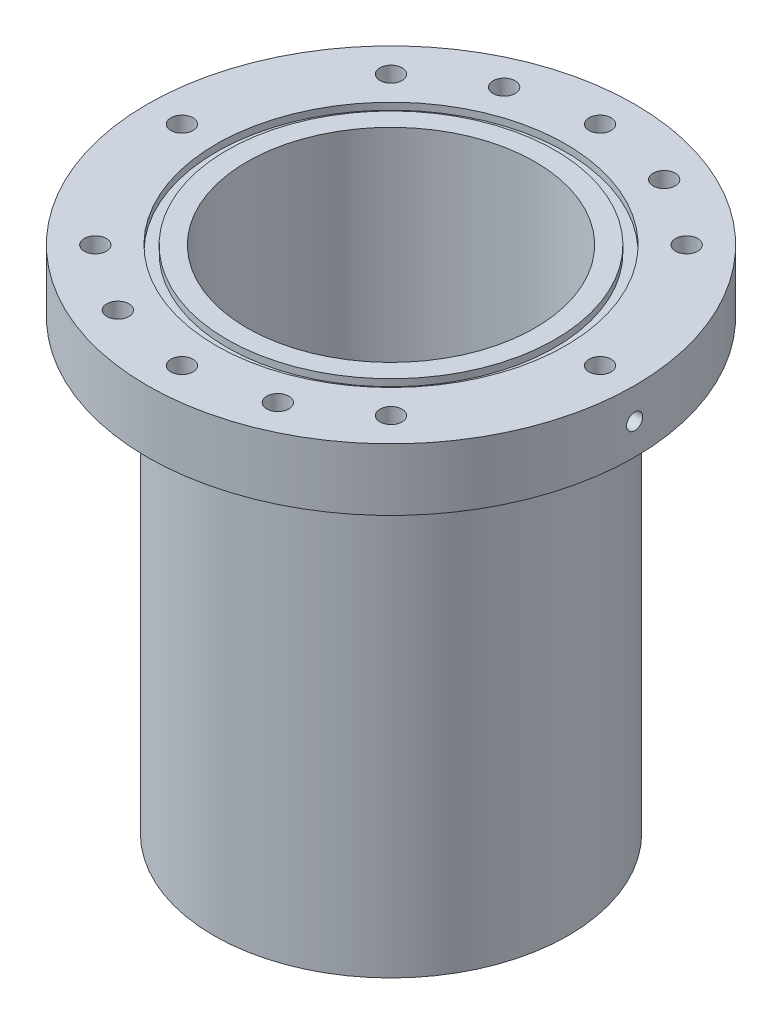
ISO-10303-21;
HEADER;
FILE_DESCRIPTION(('STEP AP214'),'2;1');
FILE_NAME('part.step','',(''),(''),'','','');
FILE_SCHEMA(('AUTOMOTIVE_DESIGN { 1 0 10303 214 1 1 1 1 }'));
ENDSEC;
DATA;
#1=APPLICATION_CONTEXT('core data for automotive mechanical design processes');
#2=APPLICATION_PROTOCOL_DEFINITION('international standard','automotive_design',2000,#1);
#3=PRODUCT_CONTEXT('',#1,'mechanical');
#4=PRODUCT('Part','Part','',(#3));
#5=PRODUCT_RELATED_PRODUCT_CATEGORY('part','',(#4));
#6=PRODUCT_DEFINITION_FORMATION('','',#4);
#7=PRODUCT_DEFINITION_CONTEXT('part definition',#1,'design');
#8=PRODUCT_DEFINITION('design','',#6,#7);
#9=PRODUCT_DEFINITION_SHAPE('','',#8);
#10=(LENGTH_UNIT() NAMED_UNIT(*) SI_UNIT(.MILLI.,.METRE.));
#11=(NAMED_UNIT(*) PLANE_ANGLE_UNIT() SI_UNIT($,.RADIAN.));
#12=(NAMED_UNIT(*) SI_UNIT($,.STERADIAN.) SOLID_ANGLE_UNIT());
#13=UNCERTAINTY_MEASURE_WITH_UNIT(LENGTH_MEASURE(1.E-05),#10,'distance_accuracy_value','');
#14=(GEOMETRIC_REPRESENTATION_CONTEXT(3) GLOBAL_UNCERTAINTY_ASSIGNED_CONTEXT((#13)) GLOBAL_UNIT_ASSIGNED_CONTEXT((#10,
#11,#12)) REPRESENTATION_CONTEXT('',''));
#15=CARTESIAN_POINT('',(0.,0.,0.));
#16=DIRECTION('',(0.,0.,1.));
#17=DIRECTION('',(1.,0.,0.));
#18=AXIS2_PLACEMENT_3D('',#15,#16,#17);
#19=CARTESIAN_POINT('',(0.,292.1,0.));
#20=DIRECTION('',(0.,-1.,0.));
#21=DIRECTION('',(0.,0.,-1.));
#22=AXIS2_PLACEMENT_3D('',#19,#20,#21);
#23=CYLINDRICAL_SURFACE('',#22,50.8);
#24=CARTESIAN_POINT('',(0.,269.5575,0.));
#25=DIRECTION('',(0.,1.,0.));
#26=DIRECTION('',(0.,0.,1.));
#27=AXIS2_PLACEMENT_3D('',#24,#25,#26);
#28=CIRCLE('',#27,50.8);
#29=CARTESIAN_POINT('',(0.,269.5575,50.8));
#30=VERTEX_POINT('',#29);
#31=EDGE_CURVE('E190',#30,#30,#28,.F.);
#32=ORIENTED_EDGE('',*,*,#31,.T.);
#33=EDGE_LOOP('',(#32));
#34=FACE_BOUND('',#33,.T.);
#35=CARTESIAN_POINT('',(0.,146.05,0.));
#36=DIRECTION('',(0.,-1.,0.));
#37=DIRECTION('',(0.,0.,-1.));
#38=AXIS2_PLACEMENT_3D('',#35,#36,#37);
#39=CIRCLE('',#38,50.8);
#40=CARTESIAN_POINT('',(0.,146.05,-50.8));
#41=VERTEX_POINT('',#40);
#42=EDGE_CURVE('E193',#41,#41,#39,.T.);
#43=ORIENTED_EDGE('',*,*,#42,.F.);
#44=EDGE_LOOP('',(#43));
#45=FACE_BOUND('',#44,.T.);
#46=ADVANCED_FACE('F33',(#34,#45),#23,.T.);
#47=CARTESIAN_POINT('',(0.,292.1,0.));
#48=DIRECTION('',(0.,-1.,0.));
#49=DIRECTION('',(0.,0.,-1.));
#50=AXIS2_PLACEMENT_3D('',#47,#48,#49);
#51=CYLINDRICAL_SURFACE('',#50,41.275);
#52=CARTESIAN_POINT('',(0.,292.1,0.));
#53=DIRECTION('',(0.,1.,0.));
#54=DIRECTION('',(0.,0.,1.));
#55=AXIS2_PLACEMENT_3D('',#52,#53,#54);
#56=CIRCLE('',#55,41.275);
#57=CARTESIAN_POINT('',(0.,292.1,41.275));
#58=VERTEX_POINT('',#57);
#59=EDGE_CURVE('E294',#58,#58,#56,.T.);
#60=ORIENTED_EDGE('',*,*,#59,.T.);
#61=EDGE_LOOP('',(#60));
#62=FACE_BOUND('',#61,.T.);
#63=CARTESIAN_POINT('',(0.,146.05,0.));
#64=DIRECTION('',(0.,-1.,0.));
#65=DIRECTION('',(0.,0.,-1.));
#66=AXIS2_PLACEMENT_3D('',#63,#64,#65);
#67=CIRCLE('',#66,41.275);
#68=CARTESIAN_POINT('',(0.,146.05,-41.275));
#69=VERTEX_POINT('',#68);
#70=EDGE_CURVE('E37',#69,#69,#67,.T.);
#71=ORIENTED_EDGE('',*,*,#70,.T.);
#72=EDGE_LOOP('',(#71));
#73=FACE_BOUND('',#72,.T.);
#74=ADVANCED_FACE('F180',(#62,#73),#51,.F.);
#75=CARTESIAN_POINT('',(0.,274.32,0.));
#76=DIRECTION('',(0.,1.,0.));
#77=DIRECTION('',(0.,0.,1.));
#78=AXIS2_PLACEMENT_3D('',#75,#76,#77);
#79=CYLINDRICAL_SURFACE('',#78,69.85);
#80=CARTESIAN_POINT('',(69.8117463614827,283.21,-2.3114));
#81=CARTESIAN_POINT('',(69.8117468773619,283.339794212709,-2.31139425584525));
#82=CARTESIAN_POINT('',(69.8121122207272,283.469681633837,-2.30043061613104));
#83=CARTESIAN_POINT('',(69.8135344596974,283.725876692424,-2.25684808828962));
#84=CARTESIAN_POINT('',(69.8145921799757,283.852179873374,-2.22420337568277));
#85=CARTESIAN_POINT('',(69.8172792245899,284.097457921225,-2.13819138738273));
#86=CARTESIAN_POINT('',(69.8189082678216,284.216436358291,-2.08483430128465));
#87=CARTESIAN_POINT('',(69.8225540390404,284.443714312266,-1.95892691975963));
#88=CARTESIAN_POINT('',(69.8245706727383,284.552016416733,-1.88638129072129));
#89=CARTESIAN_POINT('',(69.8287656198329,284.754957345675,-1.72411207413871));
#90=CARTESIAN_POINT('',(69.8309440050557,284.849590044616,-1.63438082700794));
#91=CARTESIAN_POINT('',(69.8352162830058,285.022454195481,-1.44030133615428));
#92=CARTESIAN_POINT('',(69.8373101723555,285.100684992288,-1.33595250886022));
#93=CARTESIAN_POINT('',(69.8411778374989,285.238535920976,-1.11557502998445));
#94=CARTESIAN_POINT('',(69.8429515457036,285.298152125327,-0.999543920354352));
#95=CARTESIAN_POINT('',(69.8459783152063,285.397056117881,-0.759113043697639));
#96=CARTESIAN_POINT('',(69.8472313788171,285.436343996383,-0.634713313847597));
#97=CARTESIAN_POINT('',(69.849075202291,285.493462234114,-0.381125061921425));
#98=CARTESIAN_POINT('',(69.8496662064781,285.511300509204,-0.251938324619293));
#99=CARTESIAN_POINT('',(69.8501201120575,285.525037572479,0.007597260512228));
#100=CARTESIAN_POINT('',(69.849983016699,285.52093645857,0.137946103153015));
#101=CARTESIAN_POINT('',(69.8489963849379,285.490917818599,0.396052155047638));
#102=CARTESIAN_POINT('',(69.8481471274241,285.465008832671,0.523810358762381));
#103=CARTESIAN_POINT('',(69.8458321994615,285.392123125957,0.773162972391011));
#104=CARTESIAN_POINT('',(69.8443665275071,285.34514635371,0.894757367248657));
#105=CARTESIAN_POINT('',(69.8409834677851,285.231448784263,1.12835822501467));
#106=CARTESIAN_POINT('',(69.8390659905574,285.164724076187,1.24036278308469));
#107=CARTESIAN_POINT('',(69.8349953960301,285.013427604563,1.45158368452496));
#108=CARTESIAN_POINT('',(69.8328422780546,284.92885578983,1.550799991218));
#109=CARTESIAN_POINT('',(69.8285418112041,284.744217457075,1.73367778981211));
#110=CARTESIAN_POINT('',(69.8263944655901,284.644143529213,1.81733180080022));
#111=CARTESIAN_POINT('',(69.8223486749986,284.431367828141,1.9666527751415));
#112=CARTESIAN_POINT('',(69.8204502300645,284.318666052731,2.03231973536185));
#113=CARTESIAN_POINT('',(69.8171163815694,284.083829611346,2.1438017645366));
#114=CARTESIAN_POINT('',(69.8156809837753,283.961694827914,2.18961658625195));
#115=CARTESIAN_POINT('',(69.8134353221583,283.711461264412,2.26008898246473));
#116=CARTESIAN_POINT('',(69.8126250562669,283.583362504079,2.28474662697328));
#117=CARTESIAN_POINT('',(69.8117213977751,283.32490234833,2.31219553903962));
#118=CARTESIAN_POINT('',(69.8116276653222,283.194542054972,2.31499717293728));
#119=CARTESIAN_POINT('',(69.8121667560732,282.935202123627,2.29868155429795));
#120=CARTESIAN_POINT('',(69.8127995782451,282.806222483681,2.27956433288804));
#121=CARTESIAN_POINT('',(69.8147201320302,282.553334080781,2.21996226007753));
#122=CARTESIAN_POINT('',(69.8160077191266,282.42942420537,2.17948212372558));
#123=CARTESIAN_POINT('',(69.8190925334448,282.190158519668,2.07830808670278));
#124=CARTESIAN_POINT('',(69.8208897619277,282.074802730543,2.01761413601552));
#125=CARTESIAN_POINT('',(69.8247920917541,281.855872012394,1.87770864996159));
#126=CARTESIAN_POINT('',(69.8268973090278,281.752301545702,1.79849013500608));
#127=CARTESIAN_POINT('',(69.8311778888511,281.559926293623,1.62379448748424));
#128=CARTESIAN_POINT('',(69.8333532516124,281.471121552817,1.52831730583117));
#129=CARTESIAN_POINT('',(69.8375298881899,281.310763975558,1.32377016369168));
#130=CARTESIAN_POINT('',(69.8395310943453,281.23921782521,1.21469495997378));
#131=CARTESIAN_POINT('',(69.8431328719671,281.115454074882,0.986074741766191));
#132=CARTESIAN_POINT('',(69.8447334444392,281.063236426381,0.866529753560617));
#133=CARTESIAN_POINT('',(69.8473532100259,280.979623672555,0.620388578850817));
#134=CARTESIAN_POINT('',(69.8483725238897,280.94822424228,0.4937938628431));
#135=CARTESIAN_POINT('',(69.8497153519353,280.907125059033,0.237125995264957));
#136=CARTESIAN_POINT('',(69.8500388671301,280.897425274463,0.107052848759716));
#137=CARTESIAN_POINT('',(69.8499536383382,280.900001214127,-0.152812824887092));
#138=CARTESIAN_POINT('',(69.8495452450815,280.912266412757,-0.282605456612311));
#139=CARTESIAN_POINT('',(69.8480429001965,280.958402488392,-0.538288198514968));
#140=CARTESIAN_POINT('',(69.8469489472173,280.99227340797,-0.664178301002132));
#141=CARTESIAN_POINT('',(69.8441986855557,281.080657832421,-0.90848601131836));
#142=CARTESIAN_POINT('',(69.8425423678954,281.135171666846,-1.02690349981606));
#143=CARTESIAN_POINT('',(69.8388539595652,281.263291335775,-1.25290351367169));
#144=CARTESIAN_POINT('',(69.8368218822342,281.336896492597,-1.36048642343425));
#145=CARTESIAN_POINT('',(69.832609872033,281.501142258765,-1.5618129206182));
#146=CARTESIAN_POINT('',(69.830429884377,281.591789202623,-1.65555133876786));
#147=CARTESIAN_POINT('',(69.8261678033379,281.787559956628,-1.82650585552644));
#148=CARTESIAN_POINT('',(69.8240857343093,281.892687343084,-1.90371786045364));
#149=CARTESIAN_POINT('',(69.8202534884123,282.11448096256,-2.03944369760835));
#150=CARTESIAN_POINT('',(69.8185035401748,282.231155060834,-2.09794466807615));
#151=CARTESIAN_POINT('',(69.8155369659875,282.472585081524,-2.1944593213782));
#152=CARTESIAN_POINT('',(69.814319705122,282.597331178052,-2.23249740661602));
#153=CARTESIAN_POINT('',(69.8128807818177,282.804053102636,-2.27693860396755));
#154=CARTESIAN_POINT('',(69.812457225781,282.884687465959,-2.28984533787043));
#155=CARTESIAN_POINT('',(69.8118898535325,283.046868944428,-2.30707783962195));
#156=CARTESIAN_POINT('',(69.8117460372198,283.128416059244,-2.31140361056762));
#157=CARTESIAN_POINT('',(69.8117463614827,283.21,-2.3114));
#158=B_SPLINE_CURVE_WITH_KNOTS('',3,(#80,#81,#82,#83,#84,#85,#86,#87,#88,#89,#90,#91,#92,#93,
#94,#95,#96,#97,#98,#99,#100,#101,#102,#103,#104,#105,#106,#107,#108,#109,#110,#111,#112,#113,
#114,#115,#116,#117,#118,#119,#120,#121,#122,#123,#124,#125,#126,#127,#128,#129,#130,#131,#132,
#133,#134,#135,#136,#137,#138,#139,#140,#141,#142,#143,#144,#145,#146,#147,#148,#149,#150,#151,
#152,#153,#154,#155,#156,#157),.UNSPECIFIED.,.T.,.F.,(4,2,2,2,2,2,2,2,2,2,2,2,2,2,2,2,2,2,2,2,2,
2,2,2,2,2,2,2,2,2,2,2,2,2,2,2,2,2,4),(0.,0.389084843554521,0.778633961968941,1.1679916813836,
1.55725480129594,1.94669182024494,2.33614439094841,2.72567907761067,3.11521203392691,
3.504601191025,3.89398861043624,4.28322361356179,4.67245956741996,5.06177265708409,
5.45108686328867,5.84058773489428,6.2300886743397,6.61959446450061,7.00909896574473,
7.39841871315866,7.78773790769838,8.1769712107899,8.56620547699499,8.9555866338289,
9.3449689662691,9.73450190688073,10.1240338696083,10.5134848823579,10.9029353280315,
11.2921991992574,11.6814638375128,12.070734690425,12.4599917273623,12.8493937400725,
13.238892098419,13.6286576211049,14.0179573043477,14.2625220320007,14.5070866713853),.UNSPECIFIED.);
#159=CARTESIAN_POINT('',(69.8117463614827,283.21,-2.3114));
#160=VERTEX_POINT('',#159);
#161=EDGE_CURVE('E10',#160,#160,#158,.T.);
#162=ORIENTED_EDGE('',*,*,#161,.F.);
#163=EDGE_LOOP('',(#162));
#164=FACE_BOUND('',#163,.T.);
#165=CARTESIAN_POINT('',(0.,274.32,0.));
#166=DIRECTION('',(0.,1.,0.));
#167=DIRECTION('',(0.,0.,1.));
#168=AXIS2_PLACEMENT_3D('',#165,#166,#167);
#169=CIRCLE('',#168,69.85);
#170=CARTESIAN_POINT('',(0.,274.32,69.85));
#171=VERTEX_POINT('',#170);
#172=EDGE_CURVE('E291',#171,#171,#169,.T.);
#173=ORIENTED_EDGE('',*,*,#172,.T.);
#174=EDGE_LOOP('',(#173));
#175=FACE_BOUND('',#174,.T.);
#176=CARTESIAN_POINT('',(0.,292.1,0.));
#177=DIRECTION('',(0.,1.,0.));
#178=DIRECTION('',(0.,0.,1.));
#179=AXIS2_PLACEMENT_3D('',#176,#177,#178);
#180=CIRCLE('',#179,69.85);
#181=CARTESIAN_POINT('',(0.,292.1,69.85));
#182=VERTEX_POINT('',#181);
#183=EDGE_CURVE('E288',#182,#182,#180,.T.);
#184=ORIENTED_EDGE('',*,*,#183,.F.);
#185=EDGE_LOOP('',(#184));
#186=FACE_BOUND('',#185,.T.);
#187=CARTESIAN_POINT('',(-69.8117463614827,283.21,2.3114));
#188=CARTESIAN_POINT('',(-69.8117468773619,283.08020578729,2.31139425584525));
#189=CARTESIAN_POINT('',(-69.8121122207272,282.950318366163,2.30043061613104));
#190=CARTESIAN_POINT('',(-69.8135344596974,282.694123307575,2.25684808828962));
#191=CARTESIAN_POINT('',(-69.8145921799757,282.567820126626,2.22420337568277));
#192=CARTESIAN_POINT('',(-69.8172792245899,282.322542078775,2.13819138738273));
#193=CARTESIAN_POINT('',(-69.8189082678216,282.203563641709,2.08483430128465));
#194=CARTESIAN_POINT('',(-69.8225540390404,281.976285687734,1.95892691975963));
#195=CARTESIAN_POINT('',(-69.8245706727383,281.867983583267,1.88638129072129));
#196=CARTESIAN_POINT('',(-69.8287656198329,281.665042654324,1.72411207413871));
#197=CARTESIAN_POINT('',(-69.8309440050557,281.570409955384,1.63438082700794));
#198=CARTESIAN_POINT('',(-69.8352162830058,281.397545804519,1.44030133615428));
#199=CARTESIAN_POINT('',(-69.8373101723555,281.319315007712,1.33595250886022));
#200=CARTESIAN_POINT('',(-69.8411778374989,281.181464079024,1.11557502998445));
#201=CARTESIAN_POINT('',(-69.8429515457036,281.121847874673,0.999543920354352));
#202=CARTESIAN_POINT('',(-69.8459783152063,281.022943882119,0.759113043697639));
#203=CARTESIAN_POINT('',(-69.8472313788171,280.983656003617,0.634713313847597));
#204=CARTESIAN_POINT('',(-69.849075202291,280.926537765886,0.381125061921425));
#205=CARTESIAN_POINT('',(-69.8496662064781,280.908699490796,0.251938324619293));
#206=CARTESIAN_POINT('',(-69.8501201120575,280.894962427521,-0.007597260512228));
#207=CARTESIAN_POINT('',(-69.849983016699,280.89906354143,-0.137946103153015));
#208=CARTESIAN_POINT('',(-69.8489963849379,280.929082181401,-0.396052155047638));
#209=CARTESIAN_POINT('',(-69.8481471274241,280.954991167329,-0.523810358762381));
#210=CARTESIAN_POINT('',(-69.8458321994615,281.027876874043,-0.773162972391011));
#211=CARTESIAN_POINT('',(-69.8443665275071,281.07485364629,-0.894757367248657));
#212=CARTESIAN_POINT('',(-69.8409834677851,281.188551215737,-1.12835822501467));
#213=CARTESIAN_POINT('',(-69.8390659905574,281.255275923813,-1.24036278308469));
#214=CARTESIAN_POINT('',(-69.8349953960301,281.406572395437,-1.45158368452496));
#215=CARTESIAN_POINT('',(-69.8328422780546,281.49114421017,-1.550799991218));
#216=CARTESIAN_POINT('',(-69.8285418112041,281.675782542925,-1.73367778981211));
#217=CARTESIAN_POINT('',(-69.8263944655901,281.775856470787,-1.81733180080022));
#218=CARTESIAN_POINT('',(-69.8223486749986,281.988632171859,-1.9666527751415));
#219=CARTESIAN_POINT('',(-69.8204502300645,282.101333947269,-2.03231973536185));
#220=CARTESIAN_POINT('',(-69.8171163815694,282.336170388654,-2.1438017645366));
#221=CARTESIAN_POINT('',(-69.8156809837753,282.458305172086,-2.18961658625195));
#222=CARTESIAN_POINT('',(-69.8134353221583,282.708538735588,-2.26008898246473));
#223=CARTESIAN_POINT('',(-69.8126250562669,282.836637495921,-2.28474662697328));
#224=CARTESIAN_POINT('',(-69.8117213977751,283.09509765167,-2.31219553903962));
#225=CARTESIAN_POINT('',(-69.8116276653222,283.225457945028,-2.31499717293728));
#226=CARTESIAN_POINT('',(-69.8121667560732,283.484797876373,-2.29868155429795));
#227=CARTESIAN_POINT('',(-69.8127995782451,283.613777516319,-2.27956433288804));
#228=CARTESIAN_POINT('',(-69.8147201320302,283.866665919219,-2.21996226007753));
#229=CARTESIAN_POINT('',(-69.8160077191266,283.99057579463,-2.17948212372558));
#230=CARTESIAN_POINT('',(-69.8190925334448,284.229841480332,-2.07830808670278));
#231=CARTESIAN_POINT('',(-69.8208897619277,284.345197269457,-2.01761413601552));
#232=CARTESIAN_POINT('',(-69.8247920917541,284.564127987606,-1.87770864996159));
#233=CARTESIAN_POINT('',(-69.8268973090278,284.667698454298,-1.79849013500608));
#234=CARTESIAN_POINT('',(-69.8311778888511,284.860073706377,-1.62379448748424));
#235=CARTESIAN_POINT('',(-69.8333532516124,284.948878447183,-1.52831730583117));
#236=CARTESIAN_POINT('',(-69.8375298881899,285.109236024442,-1.32377016369168));
#237=CARTESIAN_POINT('',(-69.8395310943453,285.18078217479,-1.21469495997378));
#238=CARTESIAN_POINT('',(-69.8431328719671,285.304545925118,-0.986074741766191));
#239=CARTESIAN_POINT('',(-69.8447334444392,285.356763573619,-0.866529753560617));
#240=CARTESIAN_POINT('',(-69.8473532100259,285.440376327445,-0.620388578850817));
#241=CARTESIAN_POINT('',(-69.8483725238897,285.47177575772,-0.4937938628431));
#242=CARTESIAN_POINT('',(-69.8497153519353,285.512874940967,-0.237125995264957));
#243=CARTESIAN_POINT('',(-69.8500388671301,285.522574725537,-0.107052848759716));
#244=CARTESIAN_POINT('',(-69.8499536383382,285.519998785873,0.152812824887092));
#245=CARTESIAN_POINT('',(-69.8495452450815,285.507733587243,0.282605456612311));
#246=CARTESIAN_POINT('',(-69.8480429001965,285.461597511608,0.538288198514968));
#247=CARTESIAN_POINT('',(-69.8469489472173,285.42772659203,0.664178301002132));
#248=CARTESIAN_POINT('',(-69.8441986855557,285.339342167579,0.90848601131836));
#249=CARTESIAN_POINT('',(-69.8425423678954,285.284828333153,1.02690349981606));
#250=CARTESIAN_POINT('',(-69.8388539595652,285.156708664225,1.25290351367169));
#251=CARTESIAN_POINT('',(-69.8368218822342,285.083103507403,1.36048642343425));
#252=CARTESIAN_POINT('',(-69.832609872033,284.918857741235,1.5618129206182));
#253=CARTESIAN_POINT('',(-69.830429884377,284.828210797377,1.65555133876786));
#254=CARTESIAN_POINT('',(-69.8261678033379,284.632440043372,1.82650585552644));
#255=CARTESIAN_POINT('',(-69.8240857343093,284.527312656916,1.90371786045364));
#256=CARTESIAN_POINT('',(-69.8202534884123,284.30551903744,2.03944369760835));
#257=CARTESIAN_POINT('',(-69.8185035401748,284.188844939166,2.09794466807615));
#258=CARTESIAN_POINT('',(-69.8155369659875,283.947414918476,2.1944593213782));
#259=CARTESIAN_POINT('',(-69.814319705122,283.822668821948,2.23249740661602));
#260=CARTESIAN_POINT('',(-69.8128807818177,283.615946897364,2.27693860396755));
#261=CARTESIAN_POINT('',(-69.812457225781,283.535312534041,2.28984533787043));
#262=CARTESIAN_POINT('',(-69.8118898535325,283.373131055572,2.30707783962195));
#263=CARTESIAN_POINT('',(-69.8117460372198,283.291583940756,2.31140361056762));
#264=CARTESIAN_POINT('',(-69.8117463614827,283.21,2.3114));
#265=B_SPLINE_CURVE_WITH_KNOTS('',3,(#187,#188,#189,#190,#191,#192,#193,#194,#195,#196,#197,
#198,#199,#200,#201,#202,#203,#204,#205,#206,#207,#208,#209,#210,#211,#212,#213,#214,#215,#216,
#217,#218,#219,#220,#221,#222,#223,#224,#225,#226,#227,#228,#229,#230,#231,#232,#233,#234,#235,
#236,#237,#238,#239,#240,#241,#242,#243,#244,#245,#246,#247,#248,#249,#250,#251,#252,#253,#254,
#255,#256,#257,#258,#259,#260,#261,#262,#263,#264),.UNSPECIFIED.,.T.,.F.,(4,2,2,2,2,2,2,2,2,2,2,
2,2,2,2,2,2,2,2,2,2,2,2,2,2,2,2,2,2,2,2,2,2,2,2,2,2,2,4),(0.,0.389084843554521,
0.778633961968941,1.1679916813836,1.55725480129594,1.94669182024494,2.33614439094841,
2.72567907761067,3.11521203392691,3.504601191025,3.89398861043624,4.28322361356179,
4.67245956741996,5.06177265708409,5.45108686328867,5.84058773489428,6.2300886743397,
6.61959446450061,7.00909896574473,7.39841871315866,7.78773790769838,8.1769712107899,
8.56620547699499,8.9555866338289,9.3449689662691,9.73450190688073,10.1240338696083,
10.5134848823579,10.9029353280315,11.2921991992574,11.6814638375128,12.070734690425,
12.4599917273623,12.8493937400725,13.238892098419,13.6286576211049,14.0179573043477,
14.2625220320007,14.5070866713853),.UNSPECIFIED.);
#266=CARTESIAN_POINT('',(-69.8117463614827,283.21,2.3114));
#267=VERTEX_POINT('',#266);
#268=EDGE_CURVE('E41',#267,#267,#265,.T.);
#269=ORIENTED_EDGE('',*,*,#268,.T.);
#270=EDGE_LOOP('',(#269));
#271=FACE_BOUND('',#270,.T.);
#272=ADVANCED_FACE('F57',(#164,#175,#186,#271),#79,.T.);
#273=CARTESIAN_POINT('',(0.,292.1,0.));
#274=DIRECTION('',(0.,1.,0.));
#275=DIRECTION('',(0.,0.,1.));
#276=AXIS2_PLACEMENT_3D('',#273,#274,#275);
#277=PLANE('',#276);
#278=ORIENTED_EDGE('',*,*,#59,.F.);
#279=EDGE_LOOP('',(#278));
#280=FACE_BOUND('',#279,.T.);
#281=CARTESIAN_POINT('',(0.,292.1,0.));
#282=DIRECTION('',(0.,1.,0.));
#283=DIRECTION('',(0.,0.,1.));
#284=AXIS2_PLACEMENT_3D('',#281,#282,#283);
#285=CIRCLE('',#284,47.0027);
#286=CARTESIAN_POINT('',(0.,292.1,47.0027));
#287=VERTEX_POINT('',#286);
#288=EDGE_CURVE('E281',#287,#287,#285,.T.);
#289=ORIENTED_EDGE('',*,*,#288,.T.);
#290=EDGE_LOOP('',(#289));
#291=FACE_BOUND('',#290,.T.);
#292=ADVANCED_FACE('F174',(#280,#291),#277,.T.);
#293=CARTESIAN_POINT('',(-22.9298555105109,292.1,55.3575681567308));
#294=DIRECTION('',(0.,1.,0.));
#295=DIRECTION('',(0.,0.,1.));
#296=AXIS2_PLACEMENT_3D('',#293,#294,#295);
#297=CIRCLE('',#296,3.175);
#298=CARTESIAN_POINT('',(-22.9298555105109,292.1,58.5325681567308));
#299=VERTEX_POINT('',#298);
#300=EDGE_CURVE('E226',#299,#299,#297,.T.);
#301=ORIENTED_EDGE('',*,*,#300,.F.);
#302=EDGE_LOOP('',(#301));
#303=FACE_BOUND('',#302,.T.);
#304=CARTESIAN_POINT('',(22.9298555105109,292.1,-55.3575681567308));
#305=DIRECTION('',(0.,1.,0.));
#306=DIRECTION('',(0.,0.,1.));
#307=AXIS2_PLACEMENT_3D('',#304,#305,#306);
#308=CIRCLE('',#307,3.175);
#309=CARTESIAN_POINT('',(22.9298555105109,292.1,-52.1825681567308));
#310=VERTEX_POINT('',#309);
#311=EDGE_CURVE('E239',#310,#310,#308,.T.);
#312=ORIENTED_EDGE('',*,*,#311,.F.);
#313=EDGE_LOOP('',(#312));
#314=FACE_BOUND('',#313,.T.);
#315=CARTESIAN_POINT('',(22.9298555105105,292.1,55.3575681567309));
#316=DIRECTION('',(0.,1.,0.));
#317=DIRECTION('',(0.,0.,1.));
#318=AXIS2_PLACEMENT_3D('',#315,#316,#317);
#319=CIRCLE('',#318,3.175);
#320=CARTESIAN_POINT('',(22.9298555105105,292.1,58.5325681567309));
#321=VERTEX_POINT('',#320);
#322=EDGE_CURVE('E233',#321,#321,#319,.T.);
#323=ORIENTED_EDGE('',*,*,#322,.F.);
#324=EDGE_LOOP('',(#323));
#325=FACE_BOUND('',#324,.T.);
#326=CARTESIAN_POINT('',(-22.9298555105105,292.1,-55.3575681567309));
#327=DIRECTION('',(0.,1.,0.));
#328=DIRECTION('',(0.,0.,1.));
#329=AXIS2_PLACEMENT_3D('',#326,#327,#328);
#330=CIRCLE('',#329,3.175);
#331=CARTESIAN_POINT('',(-22.9298555105105,292.1,-52.1825681567309));
#332=VERTEX_POINT('',#331);
#333=EDGE_CURVE('E232',#332,#332,#330,.T.);
#334=ORIENTED_EDGE('',*,*,#333,.F.);
#335=EDGE_LOOP('',(#334));
#336=FACE_BOUND('',#335,.T.);
#337=CARTESIAN_POINT('',(-59.9186,292.1,0.));
#338=DIRECTION('',(0.,-1.,0.));
#339=DIRECTION('',(0.,0.,-1.));
#340=AXIS2_PLACEMENT_3D('',#337,#338,#339);
#341=CIRCLE('',#340,3.175);
#342=CARTESIAN_POINT('',(-59.9186,292.1,-3.175));
#343=VERTEX_POINT('',#342);
#344=EDGE_CURVE('E253',#343,#343,#341,.T.);
#345=ORIENTED_EDGE('',*,*,#344,.T.);
#346=EDGE_LOOP('',(#345));
#347=FACE_BOUND('',#346,.T.);
#348=CARTESIAN_POINT('',(-42.3688483792043,292.1,42.3688483792043));
#349=DIRECTION('',(0.,-1.,0.));
#350=DIRECTION('',(0.,0.,-1.));
#351=AXIS2_PLACEMENT_3D('',#348,#349,#350);
#352=CIRCLE('',#351,3.175);
#353=CARTESIAN_POINT('',(-42.3688483792043,292.1,39.1938483792043));
#354=VERTEX_POINT('',#353);
#355=EDGE_CURVE('E257',#354,#354,#352,.T.);
#356=ORIENTED_EDGE('',*,*,#355,.T.);
#357=EDGE_LOOP('',(#356));
#358=FACE_BOUND('',#357,.T.);
#359=CARTESIAN_POINT('',(0.,292.1,59.9186));
#360=DIRECTION('',(0.,-1.,0.));
#361=DIRECTION('',(0.,0.,-1.));
#362=AXIS2_PLACEMENT_3D('',#359,#360,#361);
#363=CIRCLE('',#362,3.175);
#364=CARTESIAN_POINT('',(0.,292.1,56.7436));
#365=VERTEX_POINT('',#364);
#366=EDGE_CURVE('E260',#365,#365,#363,.T.);
#367=ORIENTED_EDGE('',*,*,#366,.T.);
#368=EDGE_LOOP('',(#367));
#369=FACE_BOUND('',#368,.T.);
#370=CARTESIAN_POINT('',(42.3688483792043,292.1,42.3688483792043));
#371=DIRECTION('',(0.,-1.,0.));
#372=DIRECTION('',(0.,0.,-1.));
#373=AXIS2_PLACEMENT_3D('',#370,#371,#372);
#374=CIRCLE('',#373,3.175);
#375=CARTESIAN_POINT('',(42.3688483792043,292.1,39.1938483792043));
#376=VERTEX_POINT('',#375);
#377=EDGE_CURVE('E263',#376,#376,#374,.T.);
#378=ORIENTED_EDGE('',*,*,#377,.T.);
#379=EDGE_LOOP('',(#378));
#380=FACE_BOUND('',#379,.T.);
#381=CARTESIAN_POINT('',(59.9186,292.1,0.));
#382=DIRECTION('',(0.,-1.,0.));
#383=DIRECTION('',(0.,0.,-1.));
#384=AXIS2_PLACEMENT_3D('',#381,#382,#383);
#385=CIRCLE('',#384,3.17500000000001);
#386=CARTESIAN_POINT('',(59.9186,292.1,-3.175));
#387=VERTEX_POINT('',#386);
#388=EDGE_CURVE('E266',#387,#387,#385,.T.);
#389=ORIENTED_EDGE('',*,*,#388,.T.);
#390=EDGE_LOOP('',(#389));
#391=FACE_BOUND('',#390,.T.);
#392=CARTESIAN_POINT('',(42.3688483792043,292.1,-42.3688483792043));
#393=DIRECTION('',(0.,-1.,0.));
#394=DIRECTION('',(0.,0.,-1.));
#395=AXIS2_PLACEMENT_3D('',#392,#393,#394);
#396=CIRCLE('',#395,3.17500000000001);
#397=CARTESIAN_POINT('',(42.3688483792043,292.1,-45.5438483792043));
#398=VERTEX_POINT('',#397);
#399=EDGE_CURVE('E269',#398,#398,#396,.T.);
#400=ORIENTED_EDGE('',*,*,#399,.T.);
#401=EDGE_LOOP('',(#400));
#402=FACE_BOUND('',#401,.T.);
#403=CARTESIAN_POINT('',(0.,292.1,-59.9186));
#404=DIRECTION('',(0.,-1.,0.));
#405=DIRECTION('',(0.,0.,-1.));
#406=AXIS2_PLACEMENT_3D('',#403,#404,#405);
#407=CIRCLE('',#406,3.175);
#408=CARTESIAN_POINT('',(0.,292.1,-63.0936));
#409=VERTEX_POINT('',#408);
#410=EDGE_CURVE('E272',#409,#409,#407,.T.);
#411=ORIENTED_EDGE('',*,*,#410,.T.);
#412=EDGE_LOOP('',(#411));
#413=FACE_BOUND('',#412,.T.);
#414=CARTESIAN_POINT('',(-42.3688483792043,292.1,-42.3688483792043));
#415=DIRECTION('',(0.,-1.,0.));
#416=DIRECTION('',(0.,0.,-1.));
#417=AXIS2_PLACEMENT_3D('',#414,#415,#416);
#418=CIRCLE('',#417,3.17500000000001);
#419=CARTESIAN_POINT('',(-42.3688483792043,292.1,-45.5438483792043));
#420=VERTEX_POINT('',#419);
#421=EDGE_CURVE('E250',#420,#420,#418,.T.);
#422=ORIENTED_EDGE('',*,*,#421,.T.);
#423=EDGE_LOOP('',(#422));
#424=FACE_BOUND('',#423,.T.);
#425=CARTESIAN_POINT('',(0.,292.1,0.));
#426=DIRECTION('',(0.,1.,0.));
#427=DIRECTION('',(0.,0.,1.));
#428=AXIS2_PLACEMENT_3D('',#425,#426,#427);
#429=CIRCLE('',#428,50.0761);
#430=CARTESIAN_POINT('',(0.,292.1,50.0761));
#431=VERTEX_POINT('',#430);
#432=EDGE_CURVE('E280',#431,#431,#429,.T.);
#433=ORIENTED_EDGE('',*,*,#432,.F.);
#434=EDGE_LOOP('',(#433));
#435=FACE_BOUND('',#434,.T.);
#436=ORIENTED_EDGE('',*,*,#183,.T.);
#437=EDGE_LOOP('',(#436));
#438=FACE_BOUND('',#437,.T.);
#439=ADVANCED_FACE('F169',(#303,#314,#325,#336,#347,#358,#369,#380,#391,#402,#413,#424,#435,
#438),#277,.T.);
#440=CARTESIAN_POINT('',(0.,274.32,0.));
#441=DIRECTION('',(0.,1.,0.));
#442=DIRECTION('',(0.,0.,1.));
#443=AXIS2_PLACEMENT_3D('',#440,#441,#442);
#444=PLANE('',#443);
#445=CARTESIAN_POINT('',(22.9298555105109,274.32,-55.3575681567308));
#446=DIRECTION('',(0.,1.,0.));
#447=DIRECTION('',(0.,0.,1.));
#448=AXIS2_PLACEMENT_3D('',#445,#446,#447);
#449=CIRCLE('',#448,1.4097);
#450=CARTESIAN_POINT('',(22.9298555105109,274.32,-53.9478681567308));
#451=VERTEX_POINT('',#450);
#452=EDGE_CURVE('E211',#451,#451,#449,.F.);
#453=ORIENTED_EDGE('',*,*,#452,.F.);
#454=EDGE_LOOP('',(#453));
#455=FACE_BOUND('',#454,.T.);
#456=CARTESIAN_POINT('',(-22.9298555105109,274.32,55.3575681567308));
#457=DIRECTION('',(0.,1.,0.));
#458=DIRECTION('',(0.,0.,1.));
#459=AXIS2_PLACEMENT_3D('',#456,#457,#458);
#460=CIRCLE('',#459,1.4097);
#461=CARTESIAN_POINT('',(-22.9298555105109,274.32,56.7672681567308));
#462=VERTEX_POINT('',#461);
#463=EDGE_CURVE('E218',#462,#462,#460,.F.);
#464=ORIENTED_EDGE('',*,*,#463,.F.);
#465=EDGE_LOOP('',(#464));
#466=FACE_BOUND('',#465,.T.);
#467=CARTESIAN_POINT('',(22.9298555105105,274.32,55.3575681567309));
#468=DIRECTION('',(0.,1.,0.));
#469=DIRECTION('',(0.,0.,1.));
#470=AXIS2_PLACEMENT_3D('',#467,#468,#469);
#471=CIRCLE('',#470,1.4097);
#472=CARTESIAN_POINT('',(22.9298555105105,274.32,56.7672681567309));
#473=VERTEX_POINT('',#472);
#474=EDGE_CURVE('E205',#473,#473,#471,.F.);
#475=ORIENTED_EDGE('',*,*,#474,.F.);
#476=EDGE_LOOP('',(#475));
#477=FACE_BOUND('',#476,.T.);
#478=CARTESIAN_POINT('',(-22.9298555105105,274.32,-55.3575681567309));
#479=DIRECTION('',(0.,1.,0.));
#480=DIRECTION('',(0.,0.,1.));
#481=AXIS2_PLACEMENT_3D('',#478,#479,#480);
#482=CIRCLE('',#481,1.4097);
#483=CARTESIAN_POINT('',(-22.9298555105105,274.32,-53.9478681567309));
#484=VERTEX_POINT('',#483);
#485=EDGE_CURVE('E223',#484,#484,#482,.F.);
#486=ORIENTED_EDGE('',*,*,#485,.F.);
#487=EDGE_LOOP('',(#486));
#488=FACE_BOUND('',#487,.T.);
#489=CARTESIAN_POINT('',(0.,274.32,0.));
#490=DIRECTION('',(0.,1.,0.));
#491=DIRECTION('',(0.,0.,1.));
#492=AXIS2_PLACEMENT_3D('',#489,#490,#491);
#493=CIRCLE('',#492,55.5625);
#494=CARTESIAN_POINT('',(0.,274.32,55.5625));
#495=VERTEX_POINT('',#494);
#496=EDGE_CURVE('E45',#495,#495,#493,.T.);
#497=ORIENTED_EDGE('',*,*,#496,.T.);
#498=EDGE_LOOP('',(#497));
#499=FACE_BOUND('',#498,.T.);
#500=CARTESIAN_POINT('',(-59.9186,274.32,0.));
#501=DIRECTION('',(0.,1.,0.));
#502=DIRECTION('',(0.,0.,1.));
#503=AXIS2_PLACEMENT_3D('',#500,#501,#502);
#504=CIRCLE('',#503,3.175);
#505=CARTESIAN_POINT('',(-59.9186,274.32,3.175));
#506=VERTEX_POINT('',#505);
#507=EDGE_CURVE('E284',#506,#506,#504,.T.);
#508=ORIENTED_EDGE('',*,*,#507,.T.);
#509=EDGE_LOOP('',(#508));
#510=FACE_BOUND('',#509,.T.);
#511=CARTESIAN_POINT('',(-42.3688483792043,274.32,42.3688483792043));
#512=DIRECTION('',(0.,1.,0.));
#513=DIRECTION('',(0.,0.,1.));
#514=AXIS2_PLACEMENT_3D('',#511,#512,#513);
#515=CIRCLE('',#514,3.175);
#516=CARTESIAN_POINT('',(-42.3688483792043,274.32,45.5438483792043));
#517=VERTEX_POINT('',#516);
#518=EDGE_CURVE('E316',#517,#517,#515,.T.);
#519=ORIENTED_EDGE('',*,*,#518,.T.);
#520=EDGE_LOOP('',(#519));
#521=FACE_BOUND('',#520,.T.);
#522=CARTESIAN_POINT('',(0.,274.32,59.9186));
#523=DIRECTION('',(0.,1.,0.));
#524=DIRECTION('',(0.,0.,1.));
#525=AXIS2_PLACEMENT_3D('',#522,#523,#524);
#526=CIRCLE('',#525,3.175);
#527=CARTESIAN_POINT('',(0.,274.32,63.0936));
#528=VERTEX_POINT('',#527);
#529=EDGE_CURVE('E313',#528,#528,#526,.T.);
#530=ORIENTED_EDGE('',*,*,#529,.T.);
#531=EDGE_LOOP('',(#530));
#532=FACE_BOUND('',#531,.T.);
#533=CARTESIAN_POINT('',(42.3688483792043,274.32,42.3688483792043));
#534=DIRECTION('',(0.,1.,0.));
#535=DIRECTION('',(0.,0.,1.));
#536=AXIS2_PLACEMENT_3D('',#533,#534,#535);
#537=CIRCLE('',#536,3.175);
#538=CARTESIAN_POINT('',(42.3688483792043,274.32,45.5438483792043));
#539=VERTEX_POINT('',#538);
#540=EDGE_CURVE('E310',#539,#539,#537,.T.);
#541=ORIENTED_EDGE('',*,*,#540,.T.);
#542=EDGE_LOOP('',(#541));
#543=FACE_BOUND('',#542,.T.);
#544=CARTESIAN_POINT('',(59.9186,274.32,0.));
#545=DIRECTION('',(0.,1.,0.));
#546=DIRECTION('',(0.,0.,1.));
#547=AXIS2_PLACEMENT_3D('',#544,#545,#546);
#548=CIRCLE('',#547,3.17500000000001);
#549=CARTESIAN_POINT('',(59.9186,274.32,3.17500000000001));
#550=VERTEX_POINT('',#549);
#551=EDGE_CURVE('E307',#550,#550,#548,.T.);
#552=ORIENTED_EDGE('',*,*,#551,.T.);
#553=EDGE_LOOP('',(#552));
#554=FACE_BOUND('',#553,.T.);
#555=CARTESIAN_POINT('',(42.3688483792043,274.32,-42.3688483792043));
#556=DIRECTION('',(0.,1.,0.));
#557=DIRECTION('',(0.,0.,1.));
#558=AXIS2_PLACEMENT_3D('',#555,#556,#557);
#559=CIRCLE('',#558,3.17500000000001);
#560=CARTESIAN_POINT('',(42.3688483792043,274.32,-39.1938483792043));
#561=VERTEX_POINT('',#560);
#562=EDGE_CURVE('E304',#561,#561,#559,.T.);
#563=ORIENTED_EDGE('',*,*,#562,.T.);
#564=EDGE_LOOP('',(#563));
#565=FACE_BOUND('',#564,.T.);
#566=CARTESIAN_POINT('',(0.,274.32,-59.9186));
#567=DIRECTION('',(0.,1.,0.));
#568=DIRECTION('',(0.,0.,1.));
#569=AXIS2_PLACEMENT_3D('',#566,#567,#568);
#570=CIRCLE('',#569,3.175);
#571=CARTESIAN_POINT('',(0.,274.32,-56.7436));
#572=VERTEX_POINT('',#571);
#573=EDGE_CURVE('E301',#572,#572,#570,.T.);
#574=ORIENTED_EDGE('',*,*,#573,.T.);
#575=EDGE_LOOP('',(#574));
#576=FACE_BOUND('',#575,.T.);
#577=CARTESIAN_POINT('',(-42.3688483792043,274.32,-42.3688483792043));
#578=DIRECTION('',(0.,1.,0.));
#579=DIRECTION('',(0.,0.,1.));
#580=AXIS2_PLACEMENT_3D('',#577,#578,#579);
#581=CIRCLE('',#580,3.17500000000001);
#582=CARTESIAN_POINT('',(-42.3688483792043,274.32,-39.1938483792043));
#583=VERTEX_POINT('',#582);
#584=EDGE_CURVE('E256',#583,#583,#581,.T.);
#585=ORIENTED_EDGE('',*,*,#584,.T.);
#586=EDGE_LOOP('',(#585));
#587=FACE_BOUND('',#586,.T.);
#588=ORIENTED_EDGE('',*,*,#172,.F.);
#589=EDGE_LOOP('',(#588));
#590=FACE_BOUND('',#589,.T.);
#591=ADVANCED_FACE('F166',(#455,#466,#477,#488,#499,#510,#521,#532,#543,#554,#565,#576,#587,
#590),#444,.F.);
#592=CARTESIAN_POINT('',(0.,290.1188,0.));
#593=DIRECTION('',(0.,1.,0.));
#594=DIRECTION('',(0.,0.,1.));
#595=AXIS2_PLACEMENT_3D('',#592,#593,#594);
#596=CYLINDRICAL_SURFACE('',#595,50.0761);
#597=CARTESIAN_POINT('',(0.,290.1188,0.));
#598=DIRECTION('',(0.,1.,0.));
#599=DIRECTION('',(0.,0.,1.));
#600=AXIS2_PLACEMENT_3D('',#597,#598,#599);
#601=CIRCLE('',#600,50.0761);
#602=CARTESIAN_POINT('',(0.,290.1188,50.0761));
#603=VERTEX_POINT('',#602);
#604=EDGE_CURVE('E285',#603,#603,#601,.T.);
#605=ORIENTED_EDGE('',*,*,#604,.F.);
#606=EDGE_LOOP('',(#605));
#607=FACE_BOUND('',#606,.T.);
#608=ORIENTED_EDGE('',*,*,#432,.T.);
#609=EDGE_LOOP('',(#608));
#610=FACE_BOUND('',#609,.T.);
#611=ADVANCED_FACE('F163',(#607,#610),#596,.F.);
#612=CARTESIAN_POINT('',(0.,290.1188,0.));
#613=DIRECTION('',(0.,1.,0.));
#614=DIRECTION('',(0.,0.,1.));
#615=AXIS2_PLACEMENT_3D('',#612,#613,#614);
#616=PLANE('',#615);
#617=CARTESIAN_POINT('',(0.,290.1188,0.));
#618=DIRECTION('',(0.,1.,0.));
#619=DIRECTION('',(0.,0.,1.));
#620=AXIS2_PLACEMENT_3D('',#617,#618,#619);
#621=CIRCLE('',#620,47.0027);
#622=CARTESIAN_POINT('',(0.,290.1188,47.0027));
#623=VERTEX_POINT('',#622);
#624=EDGE_CURVE('E277',#623,#623,#621,.T.);
#625=ORIENTED_EDGE('',*,*,#624,.F.);
#626=EDGE_LOOP('',(#625));
#627=FACE_BOUND('',#626,.T.);
#628=ORIENTED_EDGE('',*,*,#604,.T.);
#629=EDGE_LOOP('',(#628));
#630=FACE_BOUND('',#629,.T.);
#631=ADVANCED_FACE('F159',(#627,#630),#616,.T.);
#632=CARTESIAN_POINT('',(0.,290.1188,0.));
#633=DIRECTION('',(0.,1.,0.));
#634=DIRECTION('',(0.,0.,1.));
#635=AXIS2_PLACEMENT_3D('',#632,#633,#634);
#636=CYLINDRICAL_SURFACE('',#635,47.0027);
#637=ORIENTED_EDGE('',*,*,#624,.T.);
#638=EDGE_LOOP('',(#637));
#639=FACE_BOUND('',#638,.T.);
#640=ORIENTED_EDGE('',*,*,#288,.F.);
#641=EDGE_LOOP('',(#640));
#642=FACE_BOUND('',#641,.T.);
#643=ADVANCED_FACE('F155',(#639,#642),#636,.T.);
#644=CARTESIAN_POINT('',(-42.3688483792043,292.1,-42.3688483792043));
#645=DIRECTION('',(0.,-1.,0.));
#646=DIRECTION('',(0.,0.,-1.));
#647=AXIS2_PLACEMENT_3D('',#644,#645,#646);
#648=CYLINDRICAL_SURFACE('',#647,3.17500000000001);
#649=ORIENTED_EDGE('',*,*,#421,.F.);
#650=EDGE_LOOP('',(#649));
#651=FACE_BOUND('',#650,.T.);
#652=ORIENTED_EDGE('',*,*,#584,.F.);
#653=EDGE_LOOP('',(#652));
#654=FACE_BOUND('',#653,.T.);
#655=ADVANCED_FACE('F151',(#651,#654),#648,.F.);
#656=CARTESIAN_POINT('',(0.,292.1,-59.9186));
#657=DIRECTION('',(0.,-1.,0.));
#658=DIRECTION('',(0.,0.,-1.));
#659=AXIS2_PLACEMENT_3D('',#656,#657,#658);
#660=CYLINDRICAL_SURFACE('',#659,3.175);
#661=ORIENTED_EDGE('',*,*,#410,.F.);
#662=EDGE_LOOP('',(#661));
#663=FACE_BOUND('',#662,.T.);
#664=ORIENTED_EDGE('',*,*,#573,.F.);
#665=EDGE_LOOP('',(#664));
#666=FACE_BOUND('',#665,.T.);
#667=ADVANCED_FACE('F147',(#663,#666),#660,.F.);
#668=CARTESIAN_POINT('',(42.3688483792043,292.1,-42.3688483792043));
#669=DIRECTION('',(0.,-1.,0.));
#670=DIRECTION('',(0.,0.,-1.));
#671=AXIS2_PLACEMENT_3D('',#668,#669,#670);
#672=CYLINDRICAL_SURFACE('',#671,3.17500000000001);
#673=ORIENTED_EDGE('',*,*,#399,.F.);
#674=EDGE_LOOP('',(#673));
#675=FACE_BOUND('',#674,.T.);
#676=ORIENTED_EDGE('',*,*,#562,.F.);
#677=EDGE_LOOP('',(#676));
#678=FACE_BOUND('',#677,.T.);
#679=ADVANCED_FACE('F143',(#675,#678),#672,.F.);
#680=CARTESIAN_POINT('',(59.9186,292.1,0.));
#681=DIRECTION('',(0.,-1.,0.));
#682=DIRECTION('',(0.,0.,-1.));
#683=AXIS2_PLACEMENT_3D('',#680,#681,#682);
#684=CYLINDRICAL_SURFACE('',#683,3.17500000000001);
#685=ORIENTED_EDGE('',*,*,#388,.F.);
#686=EDGE_LOOP('',(#685));
#687=FACE_BOUND('',#686,.T.);
#688=ORIENTED_EDGE('',*,*,#551,.F.);
#689=EDGE_LOOP('',(#688));
#690=FACE_BOUND('',#689,.T.);
#691=ADVANCED_FACE('F139',(#687,#690),#684,.F.);
#692=CARTESIAN_POINT('',(42.3688483792043,292.1,42.3688483792043));
#693=DIRECTION('',(0.,-1.,0.));
#694=DIRECTION('',(0.,0.,-1.));
#695=AXIS2_PLACEMENT_3D('',#692,#693,#694);
#696=CYLINDRICAL_SURFACE('',#695,3.175);
#697=ORIENTED_EDGE('',*,*,#377,.F.);
#698=EDGE_LOOP('',(#697));
#699=FACE_BOUND('',#698,.T.);
#700=ORIENTED_EDGE('',*,*,#540,.F.);
#701=EDGE_LOOP('',(#700));
#702=FACE_BOUND('',#701,.T.);
#703=ADVANCED_FACE('F135',(#699,#702),#696,.F.);
#704=CARTESIAN_POINT('',(0.,292.1,59.9186));
#705=DIRECTION('',(0.,-1.,0.));
#706=DIRECTION('',(0.,0.,-1.));
#707=AXIS2_PLACEMENT_3D('',#704,#705,#706);
#708=CYLINDRICAL_SURFACE('',#707,3.175);
#709=ORIENTED_EDGE('',*,*,#366,.F.);
#710=EDGE_LOOP('',(#709));
#711=FACE_BOUND('',#710,.T.);
#712=ORIENTED_EDGE('',*,*,#529,.F.);
#713=EDGE_LOOP('',(#712));
#714=FACE_BOUND('',#713,.T.);
#715=ADVANCED_FACE('F131',(#711,#714),#708,.F.);
#716=CARTESIAN_POINT('',(-42.3688483792043,292.1,42.3688483792043));
#717=DIRECTION('',(0.,-1.,0.));
#718=DIRECTION('',(0.,0.,-1.));
#719=AXIS2_PLACEMENT_3D('',#716,#717,#718);
#720=CYLINDRICAL_SURFACE('',#719,3.175);
#721=ORIENTED_EDGE('',*,*,#355,.F.);
#722=EDGE_LOOP('',(#721));
#723=FACE_BOUND('',#722,.T.);
#724=ORIENTED_EDGE('',*,*,#518,.F.);
#725=EDGE_LOOP('',(#724));
#726=FACE_BOUND('',#725,.T.);
#727=ADVANCED_FACE('F127',(#723,#726),#720,.F.);
#728=CARTESIAN_POINT('',(-59.9186,292.1,0.));
#729=DIRECTION('',(0.,-1.,0.));
#730=DIRECTION('',(0.,0.,-1.));
#731=AXIS2_PLACEMENT_3D('',#728,#729,#730);
#732=CYLINDRICAL_SURFACE('',#731,3.175);
#733=ORIENTED_EDGE('',*,*,#344,.F.);
#734=EDGE_LOOP('',(#733));
#735=FACE_BOUND('',#734,.T.);
#736=ORIENTED_EDGE('',*,*,#507,.F.);
#737=EDGE_LOOP('',(#736));
#738=FACE_BOUND('',#737,.T.);
#739=ADVANCED_FACE('F124',(#735,#738),#732,.F.);
#740=CARTESIAN_POINT('',(0.,269.5575,0.));
#741=DIRECTION('',(0.,1.,0.));
#742=DIRECTION('',(0.,0.,1.));
#743=AXIS2_PLACEMENT_3D('',#740,#741,#742);
#744=TOROIDAL_SURFACE('',#743,55.5625,4.7625);
#745=ORIENTED_EDGE('',*,*,#31,.F.);
#746=EDGE_LOOP('',(#745));
#747=FACE_BOUND('',#746,.T.);
#748=ORIENTED_EDGE('',*,*,#496,.F.);
#749=EDGE_LOOP('',(#748));
#750=FACE_BOUND('',#749,.T.);
#751=ADVANCED_FACE('F35',(#747,#750),#744,.F.);
#752=CARTESIAN_POINT('',(-22.9298555105105,284.48,-55.3575681567309));
#753=DIRECTION('',(0.,1.,0.));
#754=DIRECTION('',(0.,0.,1.));
#755=AXIS2_PLACEMENT_3D('',#752,#753,#754);
#756=CYLINDRICAL_SURFACE('',#755,3.175);
#757=CARTESIAN_POINT('',(-22.9298555105105,284.48,-55.3575681567309));
#758=DIRECTION('',(0.,1.,0.));
#759=DIRECTION('',(0.,0.,1.));
#760=AXIS2_PLACEMENT_3D('',#757,#758,#759);
#761=CIRCLE('',#760,3.175);
#762=CARTESIAN_POINT('',(-22.9298555105105,284.48,-52.1825681567309));
#763=VERTEX_POINT('',#762);
#764=EDGE_CURVE('E247',#763,#763,#761,.T.);
#765=ORIENTED_EDGE('',*,*,#764,.F.);
#766=EDGE_LOOP('',(#765));
#767=FACE_BOUND('',#766,.T.);
#768=ORIENTED_EDGE('',*,*,#333,.T.);
#769=EDGE_LOOP('',(#768));
#770=FACE_BOUND('',#769,.T.);
#771=ADVANCED_FACE('F119',(#767,#770),#756,.F.);
#772=CARTESIAN_POINT('',(-22.9298555105105,284.48,-55.3575681567309));
#773=DIRECTION('',(0.,1.,0.));
#774=DIRECTION('',(0.,0.,1.));
#775=AXIS2_PLACEMENT_3D('',#772,#773,#774);
#776=PLANE('',#775);
#777=CARTESIAN_POINT('',(-22.9298555105105,284.48,-55.3575681567309));
#778=DIRECTION('',(0.,1.,0.));
#779=DIRECTION('',(0.,0.,1.));
#780=AXIS2_PLACEMENT_3D('',#777,#778,#779);
#781=CIRCLE('',#780,1.4097);
#782=CARTESIAN_POINT('',(-22.9298555105105,284.48,-53.9478681567309));
#783=VERTEX_POINT('',#782);
#784=EDGE_CURVE('E214',#783,#783,#781,.T.);
#785=ORIENTED_EDGE('',*,*,#784,.F.);
#786=EDGE_LOOP('',(#785));
#787=FACE_BOUND('',#786,.T.);
#788=ORIENTED_EDGE('',*,*,#764,.T.);
#789=EDGE_LOOP('',(#788));
#790=FACE_BOUND('',#789,.T.);
#791=ADVANCED_FACE('F101',(#787,#790),#776,.T.);
#792=CARTESIAN_POINT('',(22.9298555105105,284.48,55.3575681567309));
#793=DIRECTION('',(0.,1.,0.));
#794=DIRECTION('',(0.,0.,1.));
#795=AXIS2_PLACEMENT_3D('',#792,#793,#794);
#796=CYLINDRICAL_SURFACE('',#795,3.175);
#797=CARTESIAN_POINT('',(22.9298555105105,284.48,55.3575681567309));
#798=DIRECTION('',(0.,1.,0.));
#799=DIRECTION('',(0.,0.,1.));
#800=AXIS2_PLACEMENT_3D('',#797,#798,#799);
#801=CIRCLE('',#800,3.175);
#802=CARTESIAN_POINT('',(22.9298555105105,284.48,58.5325681567309));
#803=VERTEX_POINT('',#802);
#804=EDGE_CURVE('E229',#803,#803,#801,.T.);
#805=ORIENTED_EDGE('',*,*,#804,.F.);
#806=EDGE_LOOP('',(#805));
#807=FACE_BOUND('',#806,.T.);
#808=ORIENTED_EDGE('',*,*,#322,.T.);
#809=EDGE_LOOP('',(#808));
#810=FACE_BOUND('',#809,.T.);
#811=ADVANCED_FACE('F97',(#807,#810),#796,.F.);
#812=CARTESIAN_POINT('',(22.9298555105105,284.48,55.3575681567309));
#813=DIRECTION('',(0.,1.,0.));
#814=DIRECTION('',(0.,0.,1.));
#815=AXIS2_PLACEMENT_3D('',#812,#813,#814);
#816=PLANE('',#815);
#817=CARTESIAN_POINT('',(22.9298555105105,284.48,55.3575681567309));
#818=DIRECTION('',(0.,1.,0.));
#819=DIRECTION('',(0.,0.,1.));
#820=AXIS2_PLACEMENT_3D('',#817,#818,#819);
#821=CIRCLE('',#820,1.4097);
#822=CARTESIAN_POINT('',(22.9298555105105,284.48,56.7672681567309));
#823=VERTEX_POINT('',#822);
#824=EDGE_CURVE('E204',#823,#823,#821,.T.);
#825=ORIENTED_EDGE('',*,*,#824,.F.);
#826=EDGE_LOOP('',(#825));
#827=FACE_BOUND('',#826,.T.);
#828=ORIENTED_EDGE('',*,*,#804,.T.);
#829=EDGE_LOOP('',(#828));
#830=FACE_BOUND('',#829,.T.);
#831=ADVANCED_FACE('F93',(#827,#830),#816,.T.);
#832=CARTESIAN_POINT('',(22.9298555105109,284.48,-55.3575681567308));
#833=DIRECTION('',(0.,1.,0.));
#834=DIRECTION('',(0.,0.,1.));
#835=AXIS2_PLACEMENT_3D('',#832,#833,#834);
#836=CYLINDRICAL_SURFACE('',#835,3.175);
#837=CARTESIAN_POINT('',(22.9298555105109,284.48,-55.3575681567308));
#838=DIRECTION('',(0.,1.,0.));
#839=DIRECTION('',(0.,0.,1.));
#840=AXIS2_PLACEMENT_3D('',#837,#838,#839);
#841=CIRCLE('',#840,3.175);
#842=CARTESIAN_POINT('',(22.9298555105109,284.48,-52.1825681567308));
#843=VERTEX_POINT('',#842);
#844=EDGE_CURVE('E236',#843,#843,#841,.T.);
#845=ORIENTED_EDGE('',*,*,#844,.F.);
#846=EDGE_LOOP('',(#845));
#847=FACE_BOUND('',#846,.T.);
#848=ORIENTED_EDGE('',*,*,#311,.T.);
#849=EDGE_LOOP('',(#848));
#850=FACE_BOUND('',#849,.T.);
#851=ADVANCED_FACE('F96',(#847,#850),#836,.F.);
#852=CARTESIAN_POINT('',(22.9298555105109,284.48,-55.3575681567308));
#853=DIRECTION('',(0.,1.,0.));
#854=DIRECTION('',(0.,0.,1.));
#855=AXIS2_PLACEMENT_3D('',#852,#853,#854);
#856=PLANE('',#855);
#857=CARTESIAN_POINT('',(22.9298555105109,284.48,-55.3575681567308));
#858=DIRECTION('',(0.,1.,0.));
#859=DIRECTION('',(0.,0.,1.));
#860=AXIS2_PLACEMENT_3D('',#857,#858,#859);
#861=CIRCLE('',#860,1.4097);
#862=CARTESIAN_POINT('',(22.9298555105109,284.48,-53.9478681567308));
#863=VERTEX_POINT('',#862);
#864=EDGE_CURVE('E215',#863,#863,#861,.T.);
#865=ORIENTED_EDGE('',*,*,#864,.F.);
#866=EDGE_LOOP('',(#865));
#867=FACE_BOUND('',#866,.T.);
#868=ORIENTED_EDGE('',*,*,#844,.T.);
#869=EDGE_LOOP('',(#868));
#870=FACE_BOUND('',#869,.T.);
#871=ADVANCED_FACE('F103',(#867,#870),#856,.T.);
#872=CARTESIAN_POINT('',(-22.9298555105109,284.48,55.3575681567308));
#873=DIRECTION('',(0.,1.,0.));
#874=DIRECTION('',(0.,0.,1.));
#875=AXIS2_PLACEMENT_3D('',#872,#873,#874);
#876=CYLINDRICAL_SURFACE('',#875,3.175);
#877=CARTESIAN_POINT('',(-22.9298555105109,284.48,55.3575681567308));
#878=DIRECTION('',(0.,1.,0.));
#879=DIRECTION('',(0.,0.,1.));
#880=AXIS2_PLACEMENT_3D('',#877,#878,#879);
#881=CIRCLE('',#880,3.175);
#882=CARTESIAN_POINT('',(-22.9298555105109,284.48,58.5325681567308));
#883=VERTEX_POINT('',#882);
#884=EDGE_CURVE('E242',#883,#883,#881,.T.);
#885=ORIENTED_EDGE('',*,*,#884,.F.);
#886=EDGE_LOOP('',(#885));
#887=FACE_BOUND('',#886,.T.);
#888=ORIENTED_EDGE('',*,*,#300,.T.);
#889=EDGE_LOOP('',(#888));
#890=FACE_BOUND('',#889,.T.);
#891=ADVANCED_FACE('F106',(#887,#890),#876,.F.);
#892=CARTESIAN_POINT('',(-22.9298555105109,284.48,55.3575681567308));
#893=DIRECTION('',(0.,1.,0.));
#894=DIRECTION('',(0.,0.,1.));
#895=AXIS2_PLACEMENT_3D('',#892,#893,#894);
#896=PLANE('',#895);
#897=CARTESIAN_POINT('',(-22.9298555105109,284.48,55.3575681567308));
#898=DIRECTION('',(0.,1.,0.));
#899=DIRECTION('',(0.,0.,1.));
#900=AXIS2_PLACEMENT_3D('',#897,#898,#899);
#901=CIRCLE('',#900,1.4097);
#902=CARTESIAN_POINT('',(-22.9298555105109,284.48,56.7672681567308));
#903=VERTEX_POINT('',#902);
#904=EDGE_CURVE('E208',#903,#903,#901,.T.);
#905=ORIENTED_EDGE('',*,*,#904,.F.);
#906=EDGE_LOOP('',(#905));
#907=FACE_BOUND('',#906,.T.);
#908=ORIENTED_EDGE('',*,*,#884,.T.);
#909=EDGE_LOOP('',(#908));
#910=FACE_BOUND('',#909,.T.);
#911=ADVANCED_FACE('F91',(#907,#910),#896,.T.);
#912=CARTESIAN_POINT('',(-22.9298555105105,-0.000999999999973245,-55.3575681567309));
#913=DIRECTION('',(0.,1.,0.));
#914=DIRECTION('',(0.,0.,1.));
#915=AXIS2_PLACEMENT_3D('',#912,#913,#914);
#916=CYLINDRICAL_SURFACE('',#915,1.4097);
#917=ORIENTED_EDGE('',*,*,#784,.T.);
#918=EDGE_LOOP('',(#917));
#919=FACE_BOUND('',#918,.T.);
#920=ORIENTED_EDGE('',*,*,#485,.T.);
#921=EDGE_LOOP('',(#920));
#922=FACE_BOUND('',#921,.T.);
#923=ADVANCED_FACE('F81',(#919,#922),#916,.F.);
#924=CARTESIAN_POINT('',(22.9298555105105,-0.000999999999973245,55.3575681567309));
#925=DIRECTION('',(0.,1.,0.));
#926=DIRECTION('',(0.,0.,1.));
#927=AXIS2_PLACEMENT_3D('',#924,#925,#926);
#928=CYLINDRICAL_SURFACE('',#927,1.4097);
#929=ORIENTED_EDGE('',*,*,#824,.T.);
#930=EDGE_LOOP('',(#929));
#931=FACE_BOUND('',#930,.T.);
#932=ORIENTED_EDGE('',*,*,#474,.T.);
#933=EDGE_LOOP('',(#932));
#934=FACE_BOUND('',#933,.T.);
#935=ADVANCED_FACE('F77',(#931,#934),#928,.F.);
#936=CARTESIAN_POINT('',(-22.9298555105109,-0.000999999999973245,55.3575681567308));
#937=DIRECTION('',(0.,1.,0.));
#938=DIRECTION('',(0.,0.,1.));
#939=AXIS2_PLACEMENT_3D('',#936,#937,#938);
#940=CYLINDRICAL_SURFACE('',#939,1.4097);
#941=ORIENTED_EDGE('',*,*,#904,.T.);
#942=EDGE_LOOP('',(#941));
#943=FACE_BOUND('',#942,.T.);
#944=ORIENTED_EDGE('',*,*,#463,.T.);
#945=EDGE_LOOP('',(#944));
#946=FACE_BOUND('',#945,.T.);
#947=ADVANCED_FACE('F80',(#943,#946),#940,.F.);
#948=CARTESIAN_POINT('',(22.9298555105109,-0.000999999999973245,-55.3575681567308));
#949=DIRECTION('',(0.,1.,0.));
#950=DIRECTION('',(0.,0.,1.));
#951=AXIS2_PLACEMENT_3D('',#948,#949,#950);
#952=CYLINDRICAL_SURFACE('',#951,1.4097);
#953=ORIENTED_EDGE('',*,*,#864,.T.);
#954=EDGE_LOOP('',(#953));
#955=FACE_BOUND('',#954,.T.);
#956=ORIENTED_EDGE('',*,*,#452,.T.);
#957=EDGE_LOOP('',(#956));
#958=FACE_BOUND('',#957,.T.);
#959=ADVANCED_FACE('F75',(#955,#958),#952,.F.);
#960=CARTESIAN_POINT('',(-63.5,283.21,0.));
#961=DIRECTION('',(-1.,0.,0.));
#962=DIRECTION('',(0.,0.,1.));
#963=AXIS2_PLACEMENT_3D('',#960,#961,#962);
#964=CYLINDRICAL_SURFACE('',#963,2.3114);
#965=CARTESIAN_POINT('',(-63.5,283.21,0.));
#966=DIRECTION('',(1.,0.,0.));
#967=DIRECTION('',(0.,0.,-1.));
#968=AXIS2_PLACEMENT_3D('',#965,#966,#967);
#969=CIRCLE('',#968,2.3114);
#970=CARTESIAN_POINT('',(-63.5,283.21,-2.3114));
#971=VERTEX_POINT('',#970);
#972=EDGE_CURVE('E198',#971,#971,#969,.T.);
#973=ORIENTED_EDGE('',*,*,#972,.T.);
#974=EDGE_LOOP('',(#973));
#975=FACE_BOUND('',#974,.T.);
#976=ORIENTED_EDGE('',*,*,#268,.F.);
#977=EDGE_LOOP('',(#976));
#978=FACE_BOUND('',#977,.T.);
#979=ADVANCED_FACE('F70',(#975,#978),#964,.F.);
#980=CARTESIAN_POINT('',(-63.5,283.21,0.));
#981=DIRECTION('',(1.,0.,0.));
#982=DIRECTION('',(0.,0.,-1.));
#983=AXIS2_PLACEMENT_3D('',#980,#981,#982);
#984=PLANE('',#983);
#985=ORIENTED_EDGE('',*,*,#972,.F.);
#986=EDGE_LOOP('',(#985));
#987=FACE_BOUND('',#986,.T.);
#988=ADVANCED_FACE('F67',(#987),#984,.F.);
#989=CARTESIAN_POINT('',(63.5,283.21,0.));
#990=DIRECTION('',(1.,0.,0.));
#991=DIRECTION('',(0.,0.,-1.));
#992=AXIS2_PLACEMENT_3D('',#989,#990,#991);
#993=CYLINDRICAL_SURFACE('',#992,2.3114);
#994=ORIENTED_EDGE('',*,*,#161,.T.);
#995=EDGE_LOOP('',(#994));
#996=FACE_BOUND('',#995,.T.);
#997=CARTESIAN_POINT('',(63.5,283.21,0.));
#998=DIRECTION('',(1.,0.,0.));
#999=DIRECTION('',(0.,0.,-1.));
#1000=AXIS2_PLACEMENT_3D('',#997,#998,#999);
#1001=CIRCLE('',#1000,2.3114);
#1002=CARTESIAN_POINT('',(63.5,283.21,-2.3114));
#1003=VERTEX_POINT('',#1002);
#1004=EDGE_CURVE('E195',#1003,#1003,#1001,.T.);
#1005=ORIENTED_EDGE('',*,*,#1004,.F.);
#1006=EDGE_LOOP('',(#1005));
#1007=FACE_BOUND('',#1006,.T.);
#1008=ADVANCED_FACE('F61',(#996,#1007),#993,.F.);
#1009=CARTESIAN_POINT('',(63.5,283.21,0.));
#1010=DIRECTION('',(1.,0.,0.));
#1011=DIRECTION('',(0.,0.,-1.));
#1012=AXIS2_PLACEMENT_3D('',#1009,#1010,#1011);
#1013=PLANE('',#1012);
#1014=ORIENTED_EDGE('',*,*,#1004,.T.);
#1015=EDGE_LOOP('',(#1014));
#1016=FACE_BOUND('',#1015,.T.);
#1017=ADVANCED_FACE('F66',(#1016),#1013,.T.);
#1018=CARTESIAN_POINT('',(0.,146.05,0.));
#1019=DIRECTION('',(0.,-1.,0.));
#1020=DIRECTION('',(0.,0.,-1.));
#1021=AXIS2_PLACEMENT_3D('',#1018,#1019,#1020);
#1022=PLANE('',#1021);
#1023=ORIENTED_EDGE('',*,*,#70,.F.);
#1024=EDGE_LOOP('',(#1023));
#1025=FACE_BOUND('',#1024,.T.);
#1026=ORIENTED_EDGE('',*,*,#42,.T.);
#1027=EDGE_LOOP('',(#1026));
#1028=FACE_BOUND('',#1027,.T.);
#1029=ADVANCED_FACE('F399',(#1025,#1028),#1022,.T.);
#1030=CLOSED_SHELL('',(#46,#74,#272,#292,#439,#591,#611,#631,#643,#655,#667,#679,#691,#703,#715,
#727,#739,#751,#771,#791,#811,#831,#851,#871,#891,#911,#923,#935,#947,#959,#979,#988,#1008,
#1017,#1029));
#1031=MANIFOLD_SOLID_BREP('B2',#1030);
#1032=ADVANCED_BREP_SHAPE_REPRESENTATION('',(#18,#1031),#14);
#1033=SHAPE_DEFINITION_REPRESENTATION(#9,#1032);
ENDSEC;
END-ISO-10303-21;
